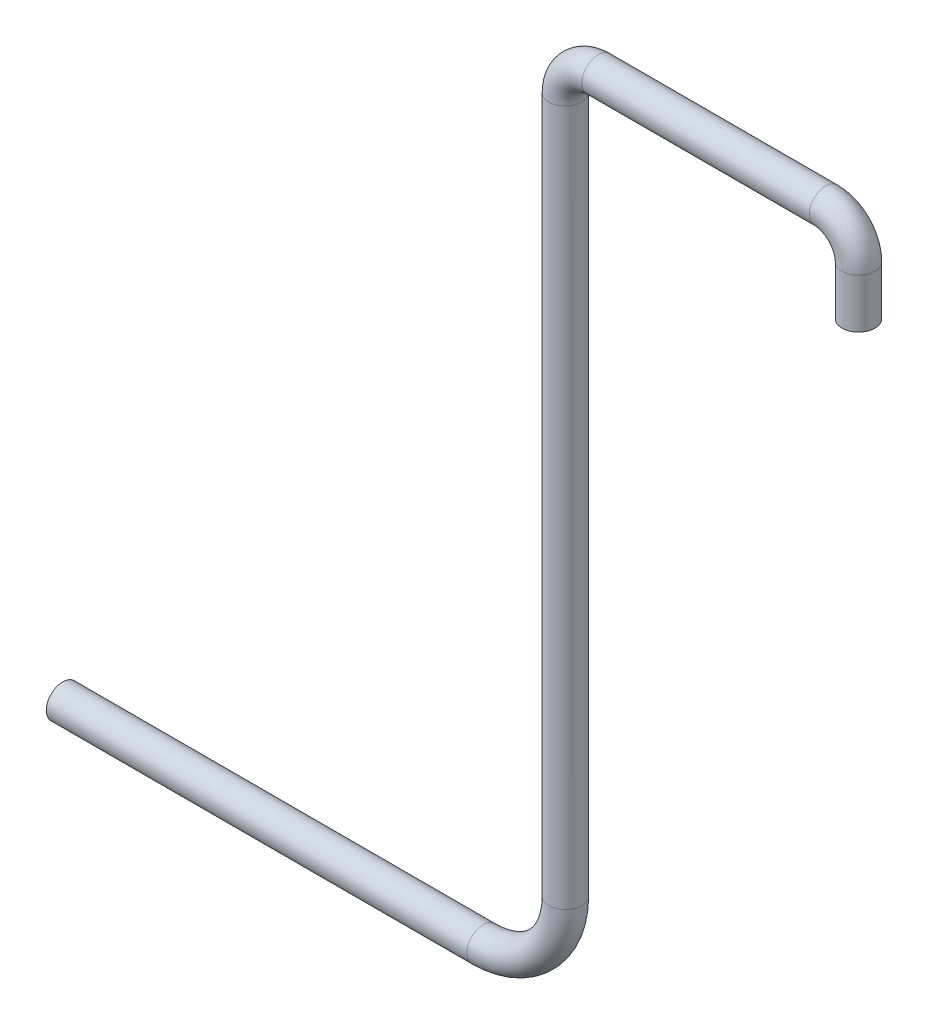
ISO-10303-21;
HEADER;
FILE_DESCRIPTION(('STEP AP214'),'2;1');
FILE_NAME('part.step','',(''),(''),'','','');
FILE_SCHEMA(('AUTOMOTIVE_DESIGN { 1 0 10303 214 1 1 1 1 }'));
ENDSEC;
DATA;
#1=APPLICATION_CONTEXT('core data for automotive mechanical design processes');
#2=APPLICATION_PROTOCOL_DEFINITION('international standard','automotive_design',2000,#1);
#3=PRODUCT_CONTEXT('',#1,'mechanical');
#4=PRODUCT('Part','Part','',(#3));
#5=PRODUCT_RELATED_PRODUCT_CATEGORY('part','',(#4));
#6=PRODUCT_DEFINITION_FORMATION('','',#4);
#7=PRODUCT_DEFINITION_CONTEXT('part definition',#1,'design');
#8=PRODUCT_DEFINITION('design','',#6,#7);
#9=PRODUCT_DEFINITION_SHAPE('','',#8);
#10=(LENGTH_UNIT() NAMED_UNIT(*) SI_UNIT(.MILLI.,.METRE.));
#11=(NAMED_UNIT(*) PLANE_ANGLE_UNIT() SI_UNIT($,.RADIAN.));
#12=(NAMED_UNIT(*) SI_UNIT($,.STERADIAN.) SOLID_ANGLE_UNIT());
#13=UNCERTAINTY_MEASURE_WITH_UNIT(LENGTH_MEASURE(1.E-05),#10,'distance_accuracy_value','');
#14=(GEOMETRIC_REPRESENTATION_CONTEXT(3) GLOBAL_UNCERTAINTY_ASSIGNED_CONTEXT((#13)) GLOBAL_UNIT_ASSIGNED_CONTEXT((#10,
#11,#12)) REPRESENTATION_CONTEXT('',''));
#15=CARTESIAN_POINT('',(0.,0.,0.));
#16=DIRECTION('',(0.,0.,1.));
#17=DIRECTION('',(1.,0.,0.));
#18=AXIS2_PLACEMENT_3D('',#15,#16,#17);
#19=CARTESIAN_POINT('',(-2.28453374132914,-4.43712093076168,0.));
#20=DIRECTION('',(-1.,0.,0.));
#21=DIRECTION('',(0.,0.,1.));
#22=AXIS2_PLACEMENT_3D('',#19,#20,#21);
#23=CYLINDRICAL_SURFACE('',#22,0.1);
#24=CARTESIAN_POINT('',(-2.28453374132914,-4.43712093076168,0.));
#25=DIRECTION('',(-1.,0.,0.));
#26=DIRECTION('',(0.,0.,1.));
#27=AXIS2_PLACEMENT_3D('',#24,#25,#26);
#28=CIRCLE('',#27,0.1);
#29=CARTESIAN_POINT('',(-2.28453374132914,-4.53712093076168,0.));
#30=VERTEX_POINT('',#29);
#31=EDGE_CURVE('E35',#30,#30,#28,.T.);
#32=ORIENTED_EDGE('',*,*,#31,.T.);
#33=EDGE_LOOP('',(#32));
#34=FACE_BOUND('',#33,.T.);
#35=CARTESIAN_POINT('',(-4.84511794502669,-4.43712093076168,0.));
#36=DIRECTION('',(-1.,0.,0.));
#37=DIRECTION('',(0.,0.,1.));
#38=AXIS2_PLACEMENT_3D('',#35,#36,#37);
#39=CIRCLE('',#38,0.1);
#40=CARTESIAN_POINT('',(-4.84511794502669,-4.43712093076168,0.1));
#41=VERTEX_POINT('',#40);
#42=EDGE_CURVE('E10',#41,#41,#39,.T.);
#43=ORIENTED_EDGE('',*,*,#42,.F.);
#44=EDGE_LOOP('',(#43));
#45=FACE_BOUND('',#44,.T.);
#46=ADVANCED_FACE('F29',(#34,#45),#23,.T.);
#47=CARTESIAN_POINT('',(-2.28453374132914,-3.93712093076168,0.));
#48=DIRECTION('',(0.,0.,-1.));
#49=DIRECTION('',(-1.,0.,0.));
#50=AXIS2_PLACEMENT_3D('',#47,#48,#49);
#51=TOROIDAL_SURFACE('',#50,0.5,0.1);
#52=CARTESIAN_POINT('',(-1.78453374132914,-3.93712093076168,0.));
#53=DIRECTION('',(0.,-1.,0.));
#54=DIRECTION('',(0.,0.,1.));
#55=AXIS2_PLACEMENT_3D('',#52,#53,#54);
#56=CIRCLE('',#55,0.1);
#57=CARTESIAN_POINT('',(-1.68453374132914,-3.93712093076168,0.));
#58=VERTEX_POINT('',#57);
#59=EDGE_CURVE('E39',#58,#58,#56,.T.);
#60=CARTESIAN_POINT('',(-2.28453374132914,-3.93712093076168,0.));
#61=DIRECTION('',(0.,0.,-1.));
#62=DIRECTION('',(-1.,0.,0.));
#63=AXIS2_PLACEMENT_3D('',#60,#61,#62);
#64=CIRCLE('',#63,0.6);
#65=EDGE_CURVE('',#58,#30,#64,.T.);
#66=ORIENTED_EDGE('',*,*,#59,.T.);
#67=ORIENTED_EDGE('',*,*,#31,.F.);
#68=ORIENTED_EDGE('',*,*,#65,.T.);
#69=ORIENTED_EDGE('',*,*,#65,.F.);
#70=EDGE_LOOP('',(#66,#68,#67,#69));
#71=FACE_BOUND('',#70,.T.);
#72=ADVANCED_FACE('F79',(#71),#51,.T.);
#73=CARTESIAN_POINT('',(-1.78453374132914,0.3,0.));
#74=DIRECTION('',(0.,-1.,0.));
#75=DIRECTION('',(0.,0.,-1.));
#76=AXIS2_PLACEMENT_3D('',#73,#74,#75);
#77=CYLINDRICAL_SURFACE('',#76,0.1);
#78=CARTESIAN_POINT('',(-1.78453374132914,0.3,0.));
#79=DIRECTION('',(0.,-1.,0.));
#80=DIRECTION('',(0.,0.,1.));
#81=AXIS2_PLACEMENT_3D('',#78,#79,#80);
#82=CIRCLE('',#81,0.1);
#83=CARTESIAN_POINT('',(-1.88453374132914,0.3,0.));
#84=VERTEX_POINT('',#83);
#85=EDGE_CURVE('E43',#84,#84,#82,.T.);
#86=ORIENTED_EDGE('',*,*,#85,.T.);
#87=EDGE_LOOP('',(#86));
#88=FACE_BOUND('',#87,.T.);
#89=ORIENTED_EDGE('',*,*,#59,.F.);
#90=EDGE_LOOP('',(#89));
#91=FACE_BOUND('',#90,.T.);
#92=ADVANCED_FACE('F83',(#88,#91),#77,.T.);
#93=CARTESIAN_POINT('',(-1.58453374132914,0.3,0.));
#94=DIRECTION('',(0.,0.,1.));
#95=DIRECTION('',(1.,0.,0.));
#96=AXIS2_PLACEMENT_3D('',#93,#94,#95);
#97=TOROIDAL_SURFACE('',#96,0.2,0.1);
#98=CARTESIAN_POINT('',(-1.58453374132914,0.5,0.));
#99=DIRECTION('',(-1.,0.,0.));
#100=DIRECTION('',(0.,0.,1.));
#101=AXIS2_PLACEMENT_3D('',#98,#99,#100);
#102=CIRCLE('',#101,0.1);
#103=CARTESIAN_POINT('',(-1.58453374132914,0.6,0.));
#104=VERTEX_POINT('',#103);
#105=EDGE_CURVE('E48',#104,#104,#102,.T.);
#106=CARTESIAN_POINT('',(-1.58453374132914,0.3,0.));
#107=DIRECTION('',(0.,0.,1.));
#108=DIRECTION('',(1.,0.,0.));
#109=AXIS2_PLACEMENT_3D('',#106,#107,#108);
#110=CIRCLE('',#109,0.3);
#111=EDGE_CURVE('',#104,#84,#110,.T.);
#112=ORIENTED_EDGE('',*,*,#105,.T.);
#113=ORIENTED_EDGE('',*,*,#85,.F.);
#114=ORIENTED_EDGE('',*,*,#111,.T.);
#115=ORIENTED_EDGE('',*,*,#111,.F.);
#116=EDGE_LOOP('',(#112,#114,#113,#115));
#117=FACE_BOUND('',#116,.T.);
#118=ADVANCED_FACE('F89',(#117),#97,.T.);
#119=CARTESIAN_POINT('',(-0.200000000000001,0.5,0.));
#120=DIRECTION('',(-1.,0.,0.));
#121=DIRECTION('',(0.,-1.,0.));
#122=AXIS2_PLACEMENT_3D('',#119,#120,#121);
#123=CYLINDRICAL_SURFACE('',#122,0.1);
#124=CARTESIAN_POINT('',(-0.200000000000001,0.5,0.));
#125=DIRECTION('',(-1.,0.,0.));
#126=DIRECTION('',(0.,0.,1.));
#127=AXIS2_PLACEMENT_3D('',#124,#125,#126);
#128=CIRCLE('',#127,0.1);
#129=CARTESIAN_POINT('',(-0.200000000000002,0.6,0.));
#130=VERTEX_POINT('',#129);
#131=EDGE_CURVE('E51',#130,#130,#128,.T.);
#132=ORIENTED_EDGE('',*,*,#131,.T.);
#133=EDGE_LOOP('',(#132));
#134=FACE_BOUND('',#133,.T.);
#135=ORIENTED_EDGE('',*,*,#105,.F.);
#136=EDGE_LOOP('',(#135));
#137=FACE_BOUND('',#136,.T.);
#138=ADVANCED_FACE('F96',(#134,#137),#123,.T.);
#139=CARTESIAN_POINT('',(-0.2,0.3,0.));
#140=DIRECTION('',(0.,0.,1.));
#141=DIRECTION('',(1.,0.,0.));
#142=AXIS2_PLACEMENT_3D('',#139,#140,#141);
#143=TOROIDAL_SURFACE('',#142,0.2,0.1);
#144=CARTESIAN_POINT('',(0.,0.299999999999999,0.));
#145=DIRECTION('',(0.,1.,0.));
#146=DIRECTION('',(0.,0.,1.));
#147=AXIS2_PLACEMENT_3D('',#144,#145,#146);
#148=CIRCLE('',#147,0.1);
#149=CARTESIAN_POINT('',(0.1,0.299999999999998,0.));
#150=VERTEX_POINT('',#149);
#151=EDGE_CURVE('E54',#150,#150,#148,.T.);
#152=CARTESIAN_POINT('',(-0.2,0.3,0.));
#153=DIRECTION('',(0.,0.,1.));
#154=DIRECTION('',(1.,0.,0.));
#155=AXIS2_PLACEMENT_3D('',#152,#153,#154);
#156=CIRCLE('',#155,0.3);
#157=EDGE_CURVE('',#150,#130,#156,.T.);
#158=ORIENTED_EDGE('',*,*,#151,.T.);
#159=ORIENTED_EDGE('',*,*,#131,.F.);
#160=ORIENTED_EDGE('',*,*,#157,.T.);
#161=ORIENTED_EDGE('',*,*,#157,.F.);
#162=EDGE_LOOP('',(#158,#160,#159,#161));
#163=FACE_BOUND('',#162,.T.);
#164=ADVANCED_FACE('F61',(#163),#143,.T.);
#165=CARTESIAN_POINT('',(0.,0.299999999999999,0.));
#166=DIRECTION('',(0.,-1.,0.));
#167=DIRECTION('',(0.,0.,-1.));
#168=AXIS2_PLACEMENT_3D('',#165,#166,#167);
#169=CYLINDRICAL_SURFACE('',#168,0.1);
#170=ORIENTED_EDGE('',*,*,#151,.F.);
#171=EDGE_LOOP('',(#170));
#172=FACE_BOUND('',#171,.T.);
#173=CARTESIAN_POINT('',(0.,0.,0.));
#174=DIRECTION('',(0.,1.,0.));
#175=DIRECTION('',(0.,0.,1.));
#176=AXIS2_PLACEMENT_3D('',#173,#174,#175);
#177=CIRCLE('',#176,0.1);
#178=CARTESIAN_POINT('',(0.,0.,0.1));
#179=VERTEX_POINT('',#178);
#180=EDGE_CURVE('E55',#179,#179,#177,.T.);
#181=ORIENTED_EDGE('',*,*,#180,.T.);
#182=EDGE_LOOP('',(#181));
#183=FACE_BOUND('',#182,.T.);
#184=ADVANCED_FACE('F64',(#172,#183),#169,.T.);
#185=CARTESIAN_POINT('',(-4.84511794502669,-4.43712093076168,0.));
#186=DIRECTION('',(-1.,0.,0.));
#187=DIRECTION('',(0.,0.,1.));
#188=AXIS2_PLACEMENT_3D('',#185,#186,#187);
#189=PLANE('',#188);
#190=ORIENTED_EDGE('',*,*,#42,.T.);
#191=EDGE_LOOP('',(#190));
#192=FACE_BOUND('',#191,.T.);
#193=ADVANCED_FACE('F67',(#192),#189,.T.);
#194=CARTESIAN_POINT('',(0.,0.,0.));
#195=DIRECTION('',(0.,1.,0.));
#196=DIRECTION('',(0.,0.,1.));
#197=AXIS2_PLACEMENT_3D('',#194,#195,#196);
#198=PLANE('',#197);
#199=ORIENTED_EDGE('',*,*,#180,.F.);
#200=EDGE_LOOP('',(#199));
#201=FACE_BOUND('',#200,.T.);
#202=ADVANCED_FACE('F71',(#201),#198,.F.);
#203=CLOSED_SHELL('',(#46,#72,#92,#118,#138,#164,#184,#193,#202));
#204=MANIFOLD_SOLID_BREP('B2',#203);
#205=ADVANCED_BREP_SHAPE_REPRESENTATION('',(#18,#204),#14);
#206=SHAPE_DEFINITION_REPRESENTATION(#9,#205);
ENDSEC;
END-ISO-10303-21;
